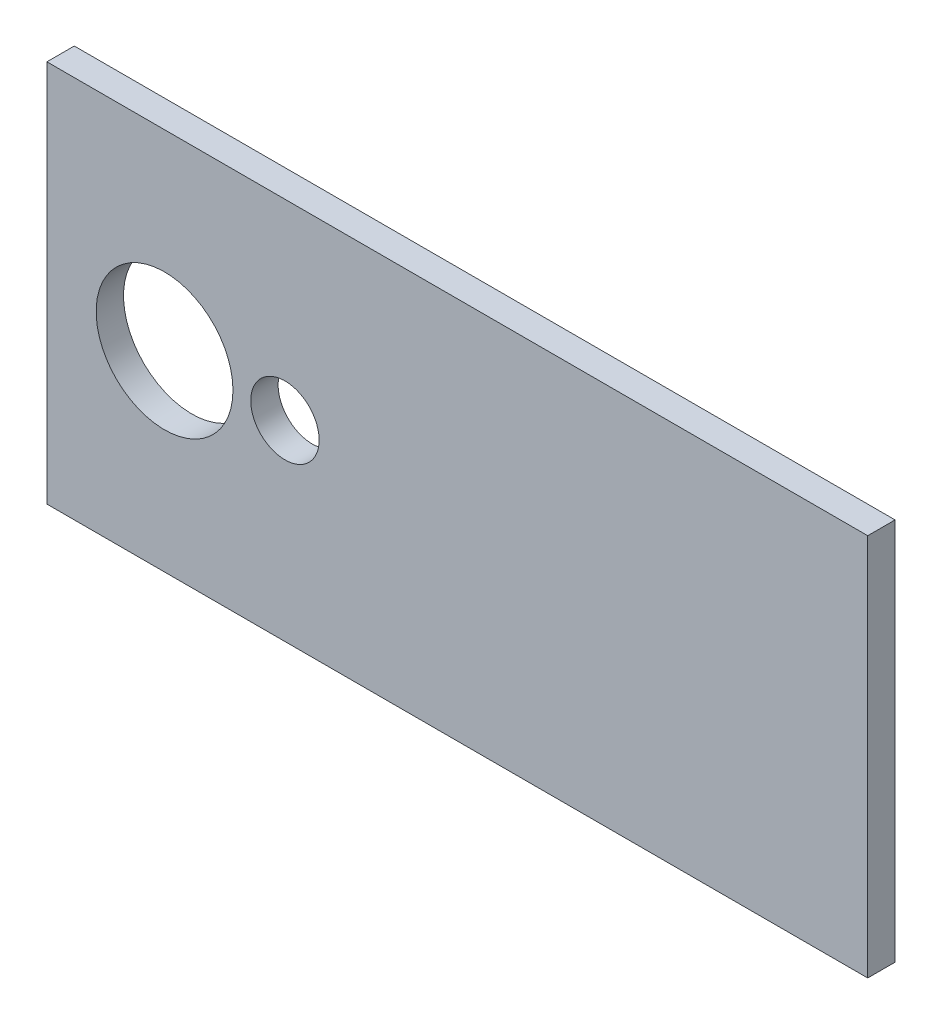
ISO-10303-21;
HEADER;
FILE_DESCRIPTION(('STEP AP214'),'2;1');
FILE_NAME('part.step','',(''),(''),'','','');
FILE_SCHEMA(('AUTOMOTIVE_DESIGN { 1 0 10303 214 1 1 1 1 }'));
ENDSEC;
DATA;
#1=APPLICATION_CONTEXT('core data for automotive mechanical design processes');
#2=APPLICATION_PROTOCOL_DEFINITION('international standard','automotive_design',2000,#1);
#3=PRODUCT_CONTEXT('',#1,'mechanical');
#4=PRODUCT('Part','Part','',(#3));
#5=PRODUCT_RELATED_PRODUCT_CATEGORY('part','',(#4));
#6=PRODUCT_DEFINITION_FORMATION('','',#4);
#7=PRODUCT_DEFINITION_CONTEXT('part definition',#1,'design');
#8=PRODUCT_DEFINITION('design','',#6,#7);
#9=PRODUCT_DEFINITION_SHAPE('','',#8);
#10=(LENGTH_UNIT() NAMED_UNIT(*) SI_UNIT(.MILLI.,.METRE.));
#11=(NAMED_UNIT(*) PLANE_ANGLE_UNIT() SI_UNIT($,.RADIAN.));
#12=(NAMED_UNIT(*) SI_UNIT($,.STERADIAN.) SOLID_ANGLE_UNIT());
#13=UNCERTAINTY_MEASURE_WITH_UNIT(LENGTH_MEASURE(1.E-05),#10,'distance_accuracy_value','');
#14=(GEOMETRIC_REPRESENTATION_CONTEXT(3) GLOBAL_UNCERTAINTY_ASSIGNED_CONTEXT((#13)) GLOBAL_UNIT_ASSIGNED_CONTEXT((#10,
#11,#12)) REPRESENTATION_CONTEXT('',''));
#15=CARTESIAN_POINT('',(0.,0.,0.));
#16=DIRECTION('',(0.,0.,1.));
#17=DIRECTION('',(1.,0.,0.));
#18=AXIS2_PLACEMENT_3D('',#15,#16,#17);
#19=CARTESIAN_POINT('',(0.,0.,3.175));
#20=DIRECTION('',(0.,0.,1.));
#21=DIRECTION('',(1.,0.,0.));
#22=AXIS2_PLACEMENT_3D('',#19,#20,#21);
#23=PLANE('',#22);
#24=CARTESIAN_POINT('',(-67.945,0.,3.175));
#25=DIRECTION('',(0.,0.,1.));
#26=DIRECTION('',(1.,0.,0.));
#27=AXIS2_PLACEMENT_3D('',#24,#25,#26);
#28=CIRCLE('',#27,15.875);
#29=CARTESIAN_POINT('',(-52.07,0.,3.175));
#30=VERTEX_POINT('',#29);
#31=EDGE_CURVE('E111',#30,#30,#28,.T.);
#32=ORIENTED_EDGE('',*,*,#31,.F.);
#33=EDGE_LOOP('',(#32));
#34=FACE_BOUND('',#33,.T.);
#35=DIRECTION('',(0.,1.,0.));
#36=VECTOR('',#35,1.);
#37=CARTESIAN_POINT('',(95.25,44.45,3.175));
#38=LINE('',#37,#36);
#39=CARTESIAN_POINT('',(95.25,-44.45,3.175));
#40=VERTEX_POINT('',#39);
#41=CARTESIAN_POINT('',(95.25,44.45,3.175));
#42=VERTEX_POINT('',#41);
#43=EDGE_CURVE('E96',#40,#42,#38,.T.);
#44=ORIENTED_EDGE('',*,*,#43,.T.);
#45=DIRECTION('',(-1.,0.,0.));
#46=VECTOR('',#45,1.);
#47=CARTESIAN_POINT('',(-95.25,44.45,3.175));
#48=LINE('',#47,#46);
#49=CARTESIAN_POINT('',(-95.25,44.45,3.175));
#50=VERTEX_POINT('',#49);
#51=EDGE_CURVE('E91',#42,#50,#48,.T.);
#52=ORIENTED_EDGE('',*,*,#51,.T.);
#53=DIRECTION('',(0.,-1.,0.));
#54=VECTOR('',#53,1.);
#55=CARTESIAN_POINT('',(-95.25,44.45,3.175));
#56=LINE('',#55,#54);
#57=CARTESIAN_POINT('',(-95.25,-44.45,3.175));
#58=VERTEX_POINT('',#57);
#59=EDGE_CURVE('E94',#50,#58,#56,.T.);
#60=ORIENTED_EDGE('',*,*,#59,.T.);
#61=DIRECTION('',(1.,0.,0.));
#62=VECTOR('',#61,1.);
#63=CARTESIAN_POINT('',(-95.25,-44.45,3.175));
#64=LINE('',#63,#62);
#65=EDGE_CURVE('E61',#58,#40,#64,.T.);
#66=ORIENTED_EDGE('',*,*,#65,.T.);
#67=EDGE_LOOP('',(#44,#52,#60,#66));
#68=FACE_BOUND('',#67,.T.);
#69=CARTESIAN_POINT('',(-40.005,0.,3.175));
#70=DIRECTION('',(0.,0.,1.));
#71=DIRECTION('',(1.,0.,0.));
#72=AXIS2_PLACEMENT_3D('',#69,#70,#71);
#73=CIRCLE('',#72,7.9375);
#74=CARTESIAN_POINT('',(-32.0675,0.,3.175));
#75=VERTEX_POINT('',#74);
#76=EDGE_CURVE('E126',#75,#75,#73,.T.);
#77=ORIENTED_EDGE('',*,*,#76,.F.);
#78=EDGE_LOOP('',(#77));
#79=FACE_BOUND('',#78,.T.);
#80=ADVANCED_FACE('F44',(#34,#68,#79),#23,.T.);
#81=CARTESIAN_POINT('',(0.,0.,-3.175));
#82=DIRECTION('',(0.,0.,1.));
#83=DIRECTION('',(1.,0.,0.));
#84=AXIS2_PLACEMENT_3D('',#81,#82,#83);
#85=PLANE('',#84);
#86=CARTESIAN_POINT('',(-67.945,0.,-3.175));
#87=DIRECTION('',(0.,0.,1.));
#88=DIRECTION('',(1.,0.,0.));
#89=AXIS2_PLACEMENT_3D('',#86,#87,#88);
#90=CIRCLE('',#89,15.875);
#91=CARTESIAN_POINT('',(-52.07,0.,-3.175));
#92=VERTEX_POINT('',#91);
#93=EDGE_CURVE('E123',#92,#92,#90,.T.);
#94=ORIENTED_EDGE('',*,*,#93,.T.);
#95=EDGE_LOOP('',(#94));
#96=FACE_BOUND('',#95,.T.);
#97=DIRECTION('',(0.,1.,0.));
#98=VECTOR('',#97,1.);
#99=CARTESIAN_POINT('',(95.25,44.45,-3.175));
#100=LINE('',#99,#98);
#101=CARTESIAN_POINT('',(95.25,-44.45,-3.175));
#102=VERTEX_POINT('',#101);
#103=CARTESIAN_POINT('',(95.25,44.45,-3.175));
#104=VERTEX_POINT('',#103);
#105=EDGE_CURVE('E108',#102,#104,#100,.T.);
#106=ORIENTED_EDGE('',*,*,#105,.F.);
#107=DIRECTION('',(1.,0.,0.));
#108=VECTOR('',#107,1.);
#109=CARTESIAN_POINT('',(-95.25,-44.45,-3.175));
#110=LINE('',#109,#108);
#111=CARTESIAN_POINT('',(-95.25,-44.45,-3.175));
#112=VERTEX_POINT('',#111);
#113=EDGE_CURVE('E84',#112,#102,#110,.T.);
#114=ORIENTED_EDGE('',*,*,#113,.F.);
#115=DIRECTION('',(0.,-1.,0.));
#116=VECTOR('',#115,1.);
#117=CARTESIAN_POINT('',(-95.25,44.45,-3.175));
#118=LINE('',#117,#116);
#119=CARTESIAN_POINT('',(-95.25,44.45,-3.175));
#120=VERTEX_POINT('',#119);
#121=EDGE_CURVE('E78',#120,#112,#118,.T.);
#122=ORIENTED_EDGE('',*,*,#121,.F.);
#123=DIRECTION('',(-1.,0.,0.));
#124=VECTOR('',#123,1.);
#125=CARTESIAN_POINT('',(-95.25,44.45,-3.175));
#126=LINE('',#125,#124);
#127=EDGE_CURVE('E100',#104,#120,#126,.T.);
#128=ORIENTED_EDGE('',*,*,#127,.F.);
#129=EDGE_LOOP('',(#106,#114,#122,#128));
#130=FACE_BOUND('',#129,.T.);
#131=CARTESIAN_POINT('',(-40.005,0.,-3.175));
#132=DIRECTION('',(0.,0.,1.));
#133=DIRECTION('',(1.,0.,0.));
#134=AXIS2_PLACEMENT_3D('',#131,#132,#133);
#135=CIRCLE('',#134,7.9375);
#136=CARTESIAN_POINT('',(-32.0675,0.,-3.175));
#137=VERTEX_POINT('',#136);
#138=EDGE_CURVE('E129',#137,#137,#135,.T.);
#139=ORIENTED_EDGE('',*,*,#138,.T.);
#140=EDGE_LOOP('',(#139));
#141=FACE_BOUND('',#140,.T.);
#142=ADVANCED_FACE('F119',(#96,#130,#141),#85,.F.);
#143=CARTESIAN_POINT('',(95.25,44.45,3.175));
#144=DIRECTION('',(-1.,0.,0.));
#145=DIRECTION('',(0.,-1.,0.));
#146=AXIS2_PLACEMENT_3D('',#143,#144,#145);
#147=PLANE('',#146);
#148=ORIENTED_EDGE('',*,*,#105,.T.);
#149=DIRECTION('',(0.,0.,-1.));
#150=VECTOR('',#149,1.);
#151=CARTESIAN_POINT('',(95.25,44.45,3.175));
#152=LINE('',#151,#150);
#153=EDGE_CURVE('E13',#42,#104,#152,.T.);
#154=ORIENTED_EDGE('',*,*,#153,.F.);
#155=ORIENTED_EDGE('',*,*,#43,.F.);
#156=DIRECTION('',(0.,0.,-1.));
#157=VECTOR('',#156,1.);
#158=CARTESIAN_POINT('',(95.25,-44.45,3.175));
#159=LINE('',#158,#157);
#160=EDGE_CURVE('E104',#40,#102,#159,.T.);
#161=ORIENTED_EDGE('',*,*,#160,.T.);
#162=EDGE_LOOP('',(#148,#154,#155,#161));
#163=FACE_BOUND('',#162,.T.);
#164=ADVANCED_FACE('F46',(#163),#147,.F.);
#165=CARTESIAN_POINT('',(-95.25,44.45,3.175));
#166=DIRECTION('',(0.,-1.,0.));
#167=DIRECTION('',(0.,0.,-1.));
#168=AXIS2_PLACEMENT_3D('',#165,#166,#167);
#169=PLANE('',#168);
#170=ORIENTED_EDGE('',*,*,#127,.T.);
#171=DIRECTION('',(0.,0.,-1.));
#172=VECTOR('',#171,1.);
#173=CARTESIAN_POINT('',(-95.25,44.45,3.175));
#174=LINE('',#173,#172);
#175=EDGE_CURVE('E53',#50,#120,#174,.T.);
#176=ORIENTED_EDGE('',*,*,#175,.F.);
#177=ORIENTED_EDGE('',*,*,#51,.F.);
#178=ORIENTED_EDGE('',*,*,#153,.T.);
#179=EDGE_LOOP('',(#170,#176,#177,#178));
#180=FACE_BOUND('',#179,.T.);
#181=ADVANCED_FACE('F99',(#180),#169,.F.);
#182=CARTESIAN_POINT('',(-95.25,44.45,3.175));
#183=DIRECTION('',(1.,0.,0.));
#184=DIRECTION('',(0.,1.,0.));
#185=AXIS2_PLACEMENT_3D('',#182,#183,#184);
#186=PLANE('',#185);
#187=ORIENTED_EDGE('',*,*,#121,.T.);
#188=DIRECTION('',(0.,0.,-1.));
#189=VECTOR('',#188,1.);
#190=CARTESIAN_POINT('',(-95.25,-44.45,3.175));
#191=LINE('',#190,#189);
#192=EDGE_CURVE('E101',#58,#112,#191,.T.);
#193=ORIENTED_EDGE('',*,*,#192,.F.);
#194=ORIENTED_EDGE('',*,*,#59,.F.);
#195=ORIENTED_EDGE('',*,*,#175,.T.);
#196=EDGE_LOOP('',(#187,#193,#194,#195));
#197=FACE_BOUND('',#196,.T.);
#198=ADVANCED_FACE('F102',(#197),#186,.F.);
#199=CARTESIAN_POINT('',(-95.25,-44.45,3.175));
#200=DIRECTION('',(0.,1.,0.));
#201=DIRECTION('',(0.,0.,1.));
#202=AXIS2_PLACEMENT_3D('',#199,#200,#201);
#203=PLANE('',#202);
#204=ORIENTED_EDGE('',*,*,#113,.T.);
#205=ORIENTED_EDGE('',*,*,#160,.F.);
#206=ORIENTED_EDGE('',*,*,#65,.F.);
#207=ORIENTED_EDGE('',*,*,#192,.T.);
#208=EDGE_LOOP('',(#204,#205,#206,#207));
#209=FACE_BOUND('',#208,.T.);
#210=ADVANCED_FACE('F116',(#209),#203,.F.);
#211=CARTESIAN_POINT('',(-67.945,0.,3.175));
#212=DIRECTION('',(0.,0.,-1.));
#213=DIRECTION('',(-1.,0.,0.));
#214=AXIS2_PLACEMENT_3D('',#211,#212,#213);
#215=CYLINDRICAL_SURFACE('',#214,15.875);
#216=ORIENTED_EDGE('',*,*,#31,.T.);
#217=EDGE_LOOP('',(#216));
#218=FACE_BOUND('',#217,.T.);
#219=ORIENTED_EDGE('',*,*,#93,.F.);
#220=EDGE_LOOP('',(#219));
#221=FACE_BOUND('',#220,.T.);
#222=ADVANCED_FACE('F147',(#218,#221),#215,.F.);
#223=CARTESIAN_POINT('',(-40.005,0.,3.175));
#224=DIRECTION('',(0.,0.,-1.));
#225=DIRECTION('',(-1.,0.,0.));
#226=AXIS2_PLACEMENT_3D('',#223,#224,#225);
#227=CYLINDRICAL_SURFACE('',#226,7.9375);
#228=ORIENTED_EDGE('',*,*,#76,.T.);
#229=EDGE_LOOP('',(#228));
#230=FACE_BOUND('',#229,.T.);
#231=ORIENTED_EDGE('',*,*,#138,.F.);
#232=EDGE_LOOP('',(#231));
#233=FACE_BOUND('',#232,.T.);
#234=ADVANCED_FACE('F135',(#230,#233),#227,.F.);
#235=CLOSED_SHELL('',(#80,#142,#164,#181,#198,#210,#222,#234));
#236=MANIFOLD_SOLID_BREP('B2',#235);
#237=ADVANCED_BREP_SHAPE_REPRESENTATION('',(#18,#236),#14);
#238=SHAPE_DEFINITION_REPRESENTATION(#9,#237);
ENDSEC;
END-ISO-10303-21;
